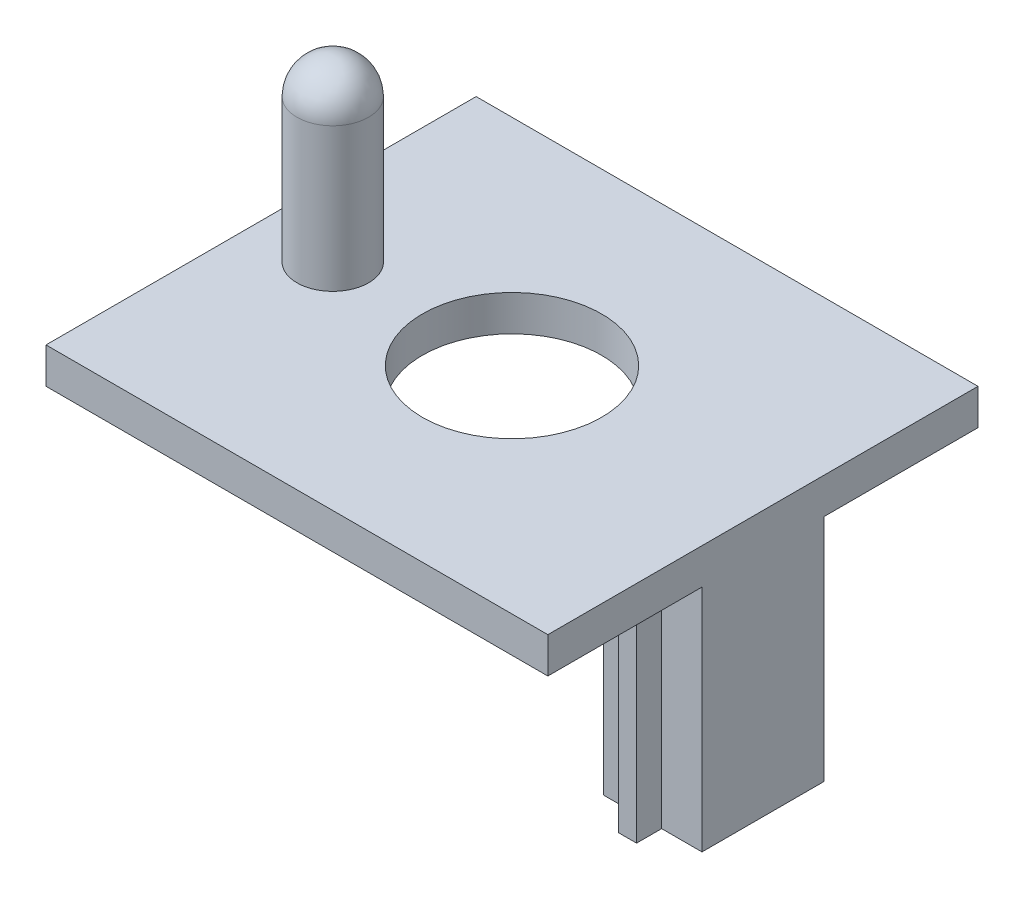
ISO-10303-21;
HEADER;
FILE_DESCRIPTION(('STEP AP214'),'2;1');
FILE_NAME('part.step','',(''),(''),'','','');
FILE_SCHEMA(('AUTOMOTIVE_DESIGN { 1 0 10303 214 1 1 1 1 }'));
ENDSEC;
DATA;
#1=APPLICATION_CONTEXT('core data for automotive mechanical design processes');
#2=APPLICATION_PROTOCOL_DEFINITION('international standard','automotive_design',2000,#1);
#3=PRODUCT_CONTEXT('',#1,'mechanical');
#4=PRODUCT('Part','Part','',(#3));
#5=PRODUCT_RELATED_PRODUCT_CATEGORY('part','',(#4));
#6=PRODUCT_DEFINITION_FORMATION('','',#4);
#7=PRODUCT_DEFINITION_CONTEXT('part definition',#1,'design');
#8=PRODUCT_DEFINITION('design','',#6,#7);
#9=PRODUCT_DEFINITION_SHAPE('','',#8);
#10=(LENGTH_UNIT() NAMED_UNIT(*) SI_UNIT(.MILLI.,.METRE.));
#11=(NAMED_UNIT(*) PLANE_ANGLE_UNIT() SI_UNIT($,.RADIAN.));
#12=(NAMED_UNIT(*) SI_UNIT($,.STERADIAN.) SOLID_ANGLE_UNIT());
#13=UNCERTAINTY_MEASURE_WITH_UNIT(LENGTH_MEASURE(1.E-05),#10,'distance_accuracy_value','');
#14=(GEOMETRIC_REPRESENTATION_CONTEXT(3) GLOBAL_UNCERTAINTY_ASSIGNED_CONTEXT((#13)) GLOBAL_UNIT_ASSIGNED_CONTEXT((#10,
#11,#12)) REPRESENTATION_CONTEXT('',''));
#15=CARTESIAN_POINT('',(0.,0.,0.));
#16=DIRECTION('',(0.,0.,1.));
#17=DIRECTION('',(1.,0.,0.));
#18=AXIS2_PLACEMENT_3D('',#15,#16,#17);
#19=CARTESIAN_POINT('',(0.,5.,0.));
#20=DIRECTION('',(0.,1.,0.));
#21=DIRECTION('',(0.,0.,1.));
#22=AXIS2_PLACEMENT_3D('',#19,#20,#21);
#23=PLANE('',#22);
#24=CARTESIAN_POINT('',(-25.,5.,0.));
#25=DIRECTION('',(0.,1.,0.));
#26=DIRECTION('',(0.,0.,1.));
#27=AXIS2_PLACEMENT_3D('',#24,#25,#26);
#28=CIRCLE('',#27,5.);
#29=CARTESIAN_POINT('',(-25.,5.,5.));
#30=VERTEX_POINT('',#29);
#31=EDGE_CURVE('E233',#30,#30,#28,.T.);
#32=ORIENTED_EDGE('',*,*,#31,.F.);
#33=EDGE_LOOP('',(#32));
#34=FACE_BOUND('',#33,.T.);
#35=DIRECTION('',(0.,0.,-1.));
#36=VECTOR('',#35,1.);
#37=CARTESIAN_POINT('',(35.,5.,-30.));
#38=LINE('',#37,#36);
#39=CARTESIAN_POINT('',(35.,5.,30.));
#40=VERTEX_POINT('',#39);
#41=CARTESIAN_POINT('',(35.,5.,-30.));
#42=VERTEX_POINT('',#41);
#43=EDGE_CURVE('E310',#40,#42,#38,.T.);
#44=ORIENTED_EDGE('',*,*,#43,.T.);
#45=DIRECTION('',(-1.,0.,0.));
#46=VECTOR('',#45,1.);
#47=CARTESIAN_POINT('',(-35.,5.,-30.));
#48=LINE('',#47,#46);
#49=CARTESIAN_POINT('',(-35.,5.,-30.));
#50=VERTEX_POINT('',#49);
#51=EDGE_CURVE('E101',#42,#50,#48,.T.);
#52=ORIENTED_EDGE('',*,*,#51,.T.);
#53=DIRECTION('',(0.,0.,1.));
#54=VECTOR('',#53,1.);
#55=CARTESIAN_POINT('',(-35.,5.,-30.));
#56=LINE('',#55,#54);
#57=CARTESIAN_POINT('',(-35.,5.,30.));
#58=VERTEX_POINT('',#57);
#59=EDGE_CURVE('E315',#50,#58,#56,.T.);
#60=ORIENTED_EDGE('',*,*,#59,.T.);
#61=DIRECTION('',(1.,0.,0.));
#62=VECTOR('',#61,1.);
#63=CARTESIAN_POINT('',(-35.,5.,30.));
#64=LINE('',#63,#62);
#65=EDGE_CURVE('E72',#58,#40,#64,.T.);
#66=ORIENTED_EDGE('',*,*,#65,.T.);
#67=EDGE_LOOP('',(#44,#52,#60,#66));
#68=FACE_BOUND('',#67,.T.);
#69=CARTESIAN_POINT('',(0.,5.,0.));
#70=DIRECTION('',(0.,1.,0.));
#71=DIRECTION('',(0.,0.,1.));
#72=AXIS2_PLACEMENT_3D('',#69,#70,#71);
#73=CIRCLE('',#72,12.5);
#74=CARTESIAN_POINT('',(0.,5.,12.5));
#75=VERTEX_POINT('',#74);
#76=EDGE_CURVE('E302',#75,#75,#73,.T.);
#77=ORIENTED_EDGE('',*,*,#76,.F.);
#78=EDGE_LOOP('',(#77));
#79=FACE_BOUND('',#78,.T.);
#80=ADVANCED_FACE('F47',(#34,#68,#79),#23,.T.);
#81=CARTESIAN_POINT('',(0.,0.,0.));
#82=DIRECTION('',(0.,1.,0.));
#83=DIRECTION('',(0.,0.,1.));
#84=AXIS2_PLACEMENT_3D('',#81,#82,#83);
#85=PLANE('',#84);
#86=DIRECTION('',(0.,0.,-1.));
#87=VECTOR('',#86,1.);
#88=CARTESIAN_POINT('',(29.375,0.,0.));
#89=LINE('',#88,#87);
#90=CARTESIAN_POINT('',(29.375,0.,12.));
#91=VERTEX_POINT('',#90);
#92=CARTESIAN_POINT('',(29.375,0.,8.5));
#93=VERTEX_POINT('',#92);
#94=EDGE_CURVE('E232',#91,#93,#89,.T.);
#95=ORIENTED_EDGE('',*,*,#94,.T.);
#96=DIRECTION('',(1.,0.,0.));
#97=VECTOR('',#96,1.);
#98=CARTESIAN_POINT('',(0.,0.,8.5));
#99=LINE('',#98,#97);
#100=CARTESIAN_POINT('',(35.,0.,8.5));
#101=VERTEX_POINT('',#100);
#102=EDGE_CURVE('E63',#93,#101,#99,.T.);
#103=ORIENTED_EDGE('',*,*,#102,.T.);
#104=DIRECTION('',(0.,0.,-1.));
#105=VECTOR('',#104,1.);
#106=CARTESIAN_POINT('',(35.,0.,-30.));
#107=LINE('',#106,#105);
#108=CARTESIAN_POINT('',(35.,0.,30.));
#109=VERTEX_POINT('',#108);
#110=EDGE_CURVE('E321',#109,#101,#107,.T.);
#111=ORIENTED_EDGE('',*,*,#110,.F.);
#112=DIRECTION('',(1.,0.,0.));
#113=VECTOR('',#112,1.);
#114=CARTESIAN_POINT('',(-35.,0.,30.));
#115=LINE('',#114,#113);
#116=CARTESIAN_POINT('',(-35.,0.,30.));
#117=VERTEX_POINT('',#116);
#118=EDGE_CURVE('E93',#117,#109,#115,.T.);
#119=ORIENTED_EDGE('',*,*,#118,.F.);
#120=DIRECTION('',(0.,0.,1.));
#121=VECTOR('',#120,1.);
#122=CARTESIAN_POINT('',(-35.,0.,-30.));
#123=LINE('',#122,#121);
#124=CARTESIAN_POINT('',(-35.,0.,-30.));
#125=VERTEX_POINT('',#124);
#126=EDGE_CURVE('E328',#125,#117,#123,.T.);
#127=ORIENTED_EDGE('',*,*,#126,.F.);
#128=DIRECTION('',(-1.,0.,0.));
#129=VECTOR('',#128,1.);
#130=CARTESIAN_POINT('',(-35.,0.,-30.));
#131=LINE('',#130,#129);
#132=CARTESIAN_POINT('',(35.,0.,-30.));
#133=VERTEX_POINT('',#132);
#134=EDGE_CURVE('E325',#133,#125,#131,.T.);
#135=ORIENTED_EDGE('',*,*,#134,.F.);
#136=CARTESIAN_POINT('',(35.,0.,-8.5));
#137=VERTEX_POINT('',#136);
#138=EDGE_CURVE('E306',#137,#133,#107,.T.);
#139=ORIENTED_EDGE('',*,*,#138,.F.);
#140=DIRECTION('',(1.,0.,0.));
#141=VECTOR('',#140,1.);
#142=CARTESIAN_POINT('',(0.,0.,-8.5));
#143=LINE('',#142,#141);
#144=CARTESIAN_POINT('',(29.375,0.,-8.5));
#145=VERTEX_POINT('',#144);
#146=EDGE_CURVE('E191',#145,#137,#143,.T.);
#147=ORIENTED_EDGE('',*,*,#146,.F.);
#148=DIRECTION('',(0.,0.,-1.));
#149=VECTOR('',#148,1.);
#150=CARTESIAN_POINT('',(29.375,0.,0.));
#151=LINE('',#150,#149);
#152=CARTESIAN_POINT('',(29.375,0.,-12.));
#153=VERTEX_POINT('',#152);
#154=EDGE_CURVE('E261',#145,#153,#151,.T.);
#155=ORIENTED_EDGE('',*,*,#154,.T.);
#156=DIRECTION('',(1.,0.,0.));
#157=VECTOR('',#156,1.);
#158=CARTESIAN_POINT('',(0.,0.,-12.));
#159=LINE('',#158,#157);
#160=CARTESIAN_POINT('',(26.875,0.,-12.));
#161=VERTEX_POINT('',#160);
#162=EDGE_CURVE('E257',#161,#153,#159,.T.);
#163=ORIENTED_EDGE('',*,*,#162,.F.);
#164=DIRECTION('',(0.,0.,-1.));
#165=VECTOR('',#164,1.);
#166=CARTESIAN_POINT('',(26.875,0.,0.));
#167=LINE('',#166,#165);
#168=CARTESIAN_POINT('',(26.875,0.,-8.5));
#169=VERTEX_POINT('',#168);
#170=EDGE_CURVE('E254',#169,#161,#167,.T.);
#171=ORIENTED_EDGE('',*,*,#170,.F.);
#172=DIRECTION('',(1.,0.,0.));
#173=VECTOR('',#172,1.);
#174=CARTESIAN_POINT('',(0.,0.,-8.5));
#175=LINE('',#174,#173);
#176=CARTESIAN_POINT('',(21.25,0.,-8.5));
#177=VERTEX_POINT('',#176);
#178=EDGE_CURVE('E251',#177,#169,#175,.T.);
#179=ORIENTED_EDGE('',*,*,#178,.F.);
#180=DIRECTION('',(0.,0.,-1.));
#181=VECTOR('',#180,1.);
#182=CARTESIAN_POINT('',(21.25,0.,0.));
#183=LINE('',#182,#181);
#184=CARTESIAN_POINT('',(21.25,0.,8.5));
#185=VERTEX_POINT('',#184);
#186=EDGE_CURVE('E248',#185,#177,#183,.T.);
#187=ORIENTED_EDGE('',*,*,#186,.F.);
#188=DIRECTION('',(1.,0.,0.));
#189=VECTOR('',#188,1.);
#190=CARTESIAN_POINT('',(0.,0.,8.5));
#191=LINE('',#190,#189);
#192=CARTESIAN_POINT('',(26.875,0.,8.5));
#193=VERTEX_POINT('',#192);
#194=EDGE_CURVE('E244',#185,#193,#191,.T.);
#195=ORIENTED_EDGE('',*,*,#194,.T.);
#196=DIRECTION('',(0.,0.,-1.));
#197=VECTOR('',#196,1.);
#198=CARTESIAN_POINT('',(26.875,0.,0.));
#199=LINE('',#198,#197);
#200=CARTESIAN_POINT('',(26.875,0.,12.));
#201=VERTEX_POINT('',#200);
#202=EDGE_CURVE('E240',#201,#193,#199,.T.);
#203=ORIENTED_EDGE('',*,*,#202,.F.);
#204=DIRECTION('',(1.,0.,0.));
#205=VECTOR('',#204,1.);
#206=CARTESIAN_POINT('',(0.,0.,12.));
#207=LINE('',#206,#205);
#208=EDGE_CURVE('E236',#201,#91,#207,.T.);
#209=ORIENTED_EDGE('',*,*,#208,.T.);
#210=EDGE_LOOP('',(#95,#103,#111,#119,#127,#135,#139,#147,#155,#163,#171,#179,#187,#195,#203,#209));
#211=FACE_BOUND('',#210,.T.);
#212=CARTESIAN_POINT('',(0.,0.,0.));
#213=DIRECTION('',(0.,1.,0.));
#214=DIRECTION('',(0.,0.,1.));
#215=AXIS2_PLACEMENT_3D('',#212,#213,#214);
#216=CIRCLE('',#215,12.5);
#217=CARTESIAN_POINT('',(0.,0.,12.5));
#218=VERTEX_POINT('',#217);
#219=EDGE_CURVE('E178',#218,#218,#216,.T.);
#220=ORIENTED_EDGE('',*,*,#219,.T.);
#221=EDGE_LOOP('',(#220));
#222=FACE_BOUND('',#221,.T.);
#223=ADVANCED_FACE('F354',(#211,#222),#85,.F.);
#224=CARTESIAN_POINT('',(35.,5.,-30.));
#225=DIRECTION('',(-1.,0.,0.));
#226=DIRECTION('',(0.,0.,1.));
#227=AXIS2_PLACEMENT_3D('',#224,#225,#226);
#228=PLANE('',#227);
#229=ORIENTED_EDGE('',*,*,#110,.T.);
#230=DIRECTION('',(0.,1.,0.));
#231=VECTOR('',#230,1.);
#232=CARTESIAN_POINT('',(35.,-32.,8.5));
#233=LINE('',#232,#231);
#234=CARTESIAN_POINT('',(35.,-32.,8.5));
#235=VERTEX_POINT('',#234);
#236=EDGE_CURVE('E229',#235,#101,#233,.T.);
#237=ORIENTED_EDGE('',*,*,#236,.F.);
#238=DIRECTION('',(0.,0.,1.));
#239=VECTOR('',#238,1.);
#240=CARTESIAN_POINT('',(35.,-32.,0.));
#241=LINE('',#240,#239);
#242=CARTESIAN_POINT('',(35.,-32.,-8.5));
#243=VERTEX_POINT('',#242);
#244=EDGE_CURVE('E188',#243,#235,#241,.T.);
#245=ORIENTED_EDGE('',*,*,#244,.F.);
#246=DIRECTION('',(0.,1.,0.));
#247=VECTOR('',#246,1.);
#248=CARTESIAN_POINT('',(35.,-32.,-8.5));
#249=LINE('',#248,#247);
#250=EDGE_CURVE('E269',#243,#137,#249,.T.);
#251=ORIENTED_EDGE('',*,*,#250,.T.);
#252=ORIENTED_EDGE('',*,*,#138,.T.);
#253=DIRECTION('',(0.,-1.,0.));
#254=VECTOR('',#253,1.);
#255=CARTESIAN_POINT('',(35.,5.,-30.));
#256=LINE('',#255,#254);
#257=EDGE_CURVE('E56',#42,#133,#256,.T.);
#258=ORIENTED_EDGE('',*,*,#257,.F.);
#259=ORIENTED_EDGE('',*,*,#43,.F.);
#260=DIRECTION('',(0.,-1.,0.));
#261=VECTOR('',#260,1.);
#262=CARTESIAN_POINT('',(35.,5.,30.));
#263=LINE('',#262,#261);
#264=EDGE_CURVE('E320',#40,#109,#263,.T.);
#265=ORIENTED_EDGE('',*,*,#264,.T.);
#266=EDGE_LOOP('',(#229,#237,#245,#251,#252,#258,#259,#265));
#267=FACE_BOUND('',#266,.T.);
#268=ADVANCED_FACE('F347',(#267),#228,.F.);
#269=CARTESIAN_POINT('',(-35.,5.,-30.));
#270=DIRECTION('',(0.,0.,1.));
#271=DIRECTION('',(1.,0.,0.));
#272=AXIS2_PLACEMENT_3D('',#269,#270,#271);
#273=PLANE('',#272);
#274=ORIENTED_EDGE('',*,*,#134,.T.);
#275=DIRECTION('',(0.,-1.,0.));
#276=VECTOR('',#275,1.);
#277=CARTESIAN_POINT('',(-35.,5.,-30.));
#278=LINE('',#277,#276);
#279=EDGE_CURVE('E338',#50,#125,#278,.T.);
#280=ORIENTED_EDGE('',*,*,#279,.F.);
#281=ORIENTED_EDGE('',*,*,#51,.F.);
#282=ORIENTED_EDGE('',*,*,#257,.T.);
#283=EDGE_LOOP('',(#274,#280,#281,#282));
#284=FACE_BOUND('',#283,.T.);
#285=ADVANCED_FACE('F343',(#284),#273,.F.);
#286=CARTESIAN_POINT('',(-35.,5.,-30.));
#287=DIRECTION('',(1.,0.,0.));
#288=DIRECTION('',(0.,0.,-1.));
#289=AXIS2_PLACEMENT_3D('',#286,#287,#288);
#290=PLANE('',#289);
#291=ORIENTED_EDGE('',*,*,#126,.T.);
#292=DIRECTION('',(0.,-1.,0.));
#293=VECTOR('',#292,1.);
#294=CARTESIAN_POINT('',(-35.,5.,30.));
#295=LINE('',#294,#293);
#296=EDGE_CURVE('E335',#58,#117,#295,.T.);
#297=ORIENTED_EDGE('',*,*,#296,.F.);
#298=ORIENTED_EDGE('',*,*,#59,.F.);
#299=ORIENTED_EDGE('',*,*,#279,.T.);
#300=EDGE_LOOP('',(#291,#297,#298,#299));
#301=FACE_BOUND('',#300,.T.);
#302=ADVANCED_FACE('F359',(#301),#290,.F.);
#303=CARTESIAN_POINT('',(-35.,5.,30.));
#304=DIRECTION('',(0.,0.,-1.));
#305=DIRECTION('',(-1.,0.,0.));
#306=AXIS2_PLACEMENT_3D('',#303,#304,#305);
#307=PLANE('',#306);
#308=ORIENTED_EDGE('',*,*,#118,.T.);
#309=ORIENTED_EDGE('',*,*,#264,.F.);
#310=ORIENTED_EDGE('',*,*,#65,.F.);
#311=ORIENTED_EDGE('',*,*,#296,.T.);
#312=EDGE_LOOP('',(#308,#309,#310,#311));
#313=FACE_BOUND('',#312,.T.);
#314=ADVANCED_FACE('F361',(#313),#307,.F.);
#315=CARTESIAN_POINT('',(0.,5.,0.));
#316=DIRECTION('',(0.,-1.,0.));
#317=DIRECTION('',(0.,0.,-1.));
#318=AXIS2_PLACEMENT_3D('',#315,#316,#317);
#319=CYLINDRICAL_SURFACE('',#318,12.5);
#320=ORIENTED_EDGE('',*,*,#76,.T.);
#321=EDGE_LOOP('',(#320));
#322=FACE_BOUND('',#321,.T.);
#323=ORIENTED_EDGE('',*,*,#219,.F.);
#324=EDGE_LOOP('',(#323));
#325=FACE_BOUND('',#324,.T.);
#326=ADVANCED_FACE('F420',(#322,#325),#319,.F.);
#327=CARTESIAN_POINT('',(0.,-32.,8.5));
#328=DIRECTION('',(0.,0.,1.));
#329=DIRECTION('',(1.,0.,0.));
#330=AXIS2_PLACEMENT_3D('',#327,#328,#329);
#331=PLANE('',#330);
#332=ORIENTED_EDGE('',*,*,#102,.F.);
#333=DIRECTION('',(0.,1.,0.));
#334=VECTOR('',#333,1.);
#335=CARTESIAN_POINT('',(29.375,-32.,8.5));
#336=LINE('',#335,#334);
#337=CARTESIAN_POINT('',(29.375,-32.,8.5));
#338=VERTEX_POINT('',#337);
#339=EDGE_CURVE('E169',#338,#93,#336,.T.);
#340=ORIENTED_EDGE('',*,*,#339,.F.);
#341=DIRECTION('',(1.,0.,0.));
#342=VECTOR('',#341,1.);
#343=CARTESIAN_POINT('',(0.,-32.,8.5));
#344=LINE('',#343,#342);
#345=EDGE_CURVE('E172',#338,#235,#344,.T.);
#346=ORIENTED_EDGE('',*,*,#345,.T.);
#347=ORIENTED_EDGE('',*,*,#236,.T.);
#348=EDGE_LOOP('',(#332,#340,#346,#347));
#349=FACE_BOUND('',#348,.T.);
#350=ADVANCED_FACE('F171',(#349),#331,.T.);
#351=CARTESIAN_POINT('',(29.375,-32.,0.));
#352=DIRECTION('',(1.,0.,0.));
#353=DIRECTION('',(0.,0.,-1.));
#354=AXIS2_PLACEMENT_3D('',#351,#352,#353);
#355=PLANE('',#354);
#356=ORIENTED_EDGE('',*,*,#94,.F.);
#357=DIRECTION('',(0.,1.,0.));
#358=VECTOR('',#357,1.);
#359=CARTESIAN_POINT('',(29.375,-32.,12.));
#360=LINE('',#359,#358);
#361=CARTESIAN_POINT('',(29.375,-32.,12.));
#362=VERTEX_POINT('',#361);
#363=EDGE_CURVE('E179',#362,#91,#360,.T.);
#364=ORIENTED_EDGE('',*,*,#363,.F.);
#365=DIRECTION('',(0.,0.,-1.));
#366=VECTOR('',#365,1.);
#367=CARTESIAN_POINT('',(29.375,-32.,0.));
#368=LINE('',#367,#366);
#369=EDGE_CURVE('E185',#362,#338,#368,.T.);
#370=ORIENTED_EDGE('',*,*,#369,.T.);
#371=ORIENTED_EDGE('',*,*,#339,.T.);
#372=EDGE_LOOP('',(#356,#364,#370,#371));
#373=FACE_BOUND('',#372,.T.);
#374=ADVANCED_FACE('F193',(#373),#355,.T.);
#375=CARTESIAN_POINT('',(0.,-32.,12.));
#376=DIRECTION('',(0.,0.,1.));
#377=DIRECTION('',(1.,0.,0.));
#378=AXIS2_PLACEMENT_3D('',#375,#376,#377);
#379=PLANE('',#378);
#380=ORIENTED_EDGE('',*,*,#208,.F.);
#381=DIRECTION('',(0.,1.,0.));
#382=VECTOR('',#381,1.);
#383=CARTESIAN_POINT('',(26.875,-32.,12.));
#384=LINE('',#383,#382);
#385=CARTESIAN_POINT('',(26.875,-32.,12.));
#386=VERTEX_POINT('',#385);
#387=EDGE_CURVE('E297',#386,#201,#384,.T.);
#388=ORIENTED_EDGE('',*,*,#387,.F.);
#389=DIRECTION('',(1.,0.,0.));
#390=VECTOR('',#389,1.);
#391=CARTESIAN_POINT('',(0.,-32.,12.));
#392=LINE('',#391,#390);
#393=EDGE_CURVE('E195',#386,#362,#392,.T.);
#394=ORIENTED_EDGE('',*,*,#393,.T.);
#395=ORIENTED_EDGE('',*,*,#363,.T.);
#396=EDGE_LOOP('',(#380,#388,#394,#395));
#397=FACE_BOUND('',#396,.T.);
#398=ADVANCED_FACE('F365',(#397),#379,.T.);
#399=CARTESIAN_POINT('',(26.875,-32.,0.));
#400=DIRECTION('',(1.,0.,0.));
#401=DIRECTION('',(0.,0.,-1.));
#402=AXIS2_PLACEMENT_3D('',#399,#400,#401);
#403=PLANE('',#402);
#404=ORIENTED_EDGE('',*,*,#202,.T.);
#405=DIRECTION('',(0.,1.,0.));
#406=VECTOR('',#405,1.);
#407=CARTESIAN_POINT('',(26.875,-32.,8.5));
#408=LINE('',#407,#406);
#409=CARTESIAN_POINT('',(26.875,-32.,8.5));
#410=VERTEX_POINT('',#409);
#411=EDGE_CURVE('E294',#410,#193,#408,.T.);
#412=ORIENTED_EDGE('',*,*,#411,.F.);
#413=DIRECTION('',(0.,0.,-1.));
#414=VECTOR('',#413,1.);
#415=CARTESIAN_POINT('',(26.875,-32.,0.));
#416=LINE('',#415,#414);
#417=EDGE_CURVE('E198',#386,#410,#416,.T.);
#418=ORIENTED_EDGE('',*,*,#417,.F.);
#419=ORIENTED_EDGE('',*,*,#387,.T.);
#420=EDGE_LOOP('',(#404,#412,#418,#419));
#421=FACE_BOUND('',#420,.T.);
#422=ADVANCED_FACE('F370',(#421),#403,.F.);
#423=CARTESIAN_POINT('',(0.,-32.,8.5));
#424=DIRECTION('',(0.,0.,1.));
#425=DIRECTION('',(1.,0.,0.));
#426=AXIS2_PLACEMENT_3D('',#423,#424,#425);
#427=PLANE('',#426);
#428=ORIENTED_EDGE('',*,*,#194,.F.);
#429=DIRECTION('',(0.,1.,0.));
#430=VECTOR('',#429,1.);
#431=CARTESIAN_POINT('',(21.25,-32.,8.5));
#432=LINE('',#431,#430);
#433=CARTESIAN_POINT('',(21.25,-32.,8.5));
#434=VERTEX_POINT('',#433);
#435=EDGE_CURVE('E291',#434,#185,#432,.T.);
#436=ORIENTED_EDGE('',*,*,#435,.F.);
#437=DIRECTION('',(1.,0.,0.));
#438=VECTOR('',#437,1.);
#439=CARTESIAN_POINT('',(0.,-32.,8.5));
#440=LINE('',#439,#438);
#441=EDGE_CURVE('E204',#434,#410,#440,.T.);
#442=ORIENTED_EDGE('',*,*,#441,.T.);
#443=ORIENTED_EDGE('',*,*,#411,.T.);
#444=EDGE_LOOP('',(#428,#436,#442,#443));
#445=FACE_BOUND('',#444,.T.);
#446=ADVANCED_FACE('F373',(#445),#427,.T.);
#447=CARTESIAN_POINT('',(21.25,-32.,0.));
#448=DIRECTION('',(1.,0.,0.));
#449=DIRECTION('',(0.,0.,-1.));
#450=AXIS2_PLACEMENT_3D('',#447,#448,#449);
#451=PLANE('',#450);
#452=ORIENTED_EDGE('',*,*,#186,.T.);
#453=DIRECTION('',(0.,1.,0.));
#454=VECTOR('',#453,1.);
#455=CARTESIAN_POINT('',(21.25,-32.,-8.5));
#456=LINE('',#455,#454);
#457=CARTESIAN_POINT('',(21.25,-32.,-8.5));
#458=VERTEX_POINT('',#457);
#459=EDGE_CURVE('E287',#458,#177,#456,.T.);
#460=ORIENTED_EDGE('',*,*,#459,.F.);
#461=DIRECTION('',(0.,0.,-1.));
#462=VECTOR('',#461,1.);
#463=CARTESIAN_POINT('',(21.25,-32.,0.));
#464=LINE('',#463,#462);
#465=EDGE_CURVE('E208',#434,#458,#464,.T.);
#466=ORIENTED_EDGE('',*,*,#465,.F.);
#467=ORIENTED_EDGE('',*,*,#435,.T.);
#468=EDGE_LOOP('',(#452,#460,#466,#467));
#469=FACE_BOUND('',#468,.T.);
#470=ADVANCED_FACE('F378',(#469),#451,.F.);
#471=CARTESIAN_POINT('',(0.,-32.,-8.5));
#472=DIRECTION('',(0.,0.,1.));
#473=DIRECTION('',(1.,0.,0.));
#474=AXIS2_PLACEMENT_3D('',#471,#472,#473);
#475=PLANE('',#474);
#476=ORIENTED_EDGE('',*,*,#178,.T.);
#477=DIRECTION('',(0.,1.,0.));
#478=VECTOR('',#477,1.);
#479=CARTESIAN_POINT('',(26.875,-32.,-8.5));
#480=LINE('',#479,#478);
#481=CARTESIAN_POINT('',(26.875,-32.,-8.5));
#482=VERTEX_POINT('',#481);
#483=EDGE_CURVE('E283',#482,#169,#480,.T.);
#484=ORIENTED_EDGE('',*,*,#483,.F.);
#485=DIRECTION('',(1.,0.,0.));
#486=VECTOR('',#485,1.);
#487=CARTESIAN_POINT('',(0.,-32.,-8.5));
#488=LINE('',#487,#486);
#489=EDGE_CURVE('E211',#458,#482,#488,.T.);
#490=ORIENTED_EDGE('',*,*,#489,.F.);
#491=ORIENTED_EDGE('',*,*,#459,.T.);
#492=EDGE_LOOP('',(#476,#484,#490,#491));
#493=FACE_BOUND('',#492,.T.);
#494=ADVANCED_FACE('F384',(#493),#475,.F.);
#495=CARTESIAN_POINT('',(26.875,-32.,0.));
#496=DIRECTION('',(1.,0.,0.));
#497=DIRECTION('',(0.,0.,-1.));
#498=AXIS2_PLACEMENT_3D('',#495,#496,#497);
#499=PLANE('',#498);
#500=ORIENTED_EDGE('',*,*,#170,.T.);
#501=DIRECTION('',(0.,1.,0.));
#502=VECTOR('',#501,1.);
#503=CARTESIAN_POINT('',(26.875,-32.,-12.));
#504=LINE('',#503,#502);
#505=CARTESIAN_POINT('',(26.875,-32.,-12.));
#506=VERTEX_POINT('',#505);
#507=EDGE_CURVE('E279',#506,#161,#504,.T.);
#508=ORIENTED_EDGE('',*,*,#507,.F.);
#509=DIRECTION('',(0.,0.,-1.));
#510=VECTOR('',#509,1.);
#511=CARTESIAN_POINT('',(26.875,-32.,0.));
#512=LINE('',#511,#510);
#513=EDGE_CURVE('E214',#482,#506,#512,.T.);
#514=ORIENTED_EDGE('',*,*,#513,.F.);
#515=ORIENTED_EDGE('',*,*,#483,.T.);
#516=EDGE_LOOP('',(#500,#508,#514,#515));
#517=FACE_BOUND('',#516,.T.);
#518=ADVANCED_FACE('F388',(#517),#499,.F.);
#519=CARTESIAN_POINT('',(0.,-32.,-12.));
#520=DIRECTION('',(0.,0.,1.));
#521=DIRECTION('',(1.,0.,0.));
#522=AXIS2_PLACEMENT_3D('',#519,#520,#521);
#523=PLANE('',#522);
#524=ORIENTED_EDGE('',*,*,#162,.T.);
#525=DIRECTION('',(0.,1.,0.));
#526=VECTOR('',#525,1.);
#527=CARTESIAN_POINT('',(29.375,-32.,-12.));
#528=LINE('',#527,#526);
#529=CARTESIAN_POINT('',(29.375,-32.,-12.));
#530=VERTEX_POINT('',#529);
#531=EDGE_CURVE('E276',#530,#153,#528,.T.);
#532=ORIENTED_EDGE('',*,*,#531,.F.);
#533=DIRECTION('',(1.,0.,0.));
#534=VECTOR('',#533,1.);
#535=CARTESIAN_POINT('',(0.,-32.,-12.));
#536=LINE('',#535,#534);
#537=EDGE_CURVE('E217',#506,#530,#536,.T.);
#538=ORIENTED_EDGE('',*,*,#537,.F.);
#539=ORIENTED_EDGE('',*,*,#507,.T.);
#540=EDGE_LOOP('',(#524,#532,#538,#539));
#541=FACE_BOUND('',#540,.T.);
#542=ADVANCED_FACE('F393',(#541),#523,.F.);
#543=CARTESIAN_POINT('',(29.375,-32.,0.));
#544=DIRECTION('',(1.,0.,0.));
#545=DIRECTION('',(0.,0.,-1.));
#546=AXIS2_PLACEMENT_3D('',#543,#544,#545);
#547=PLANE('',#546);
#548=ORIENTED_EDGE('',*,*,#154,.F.);
#549=DIRECTION('',(0.,1.,0.));
#550=VECTOR('',#549,1.);
#551=CARTESIAN_POINT('',(29.375,-32.,-8.5));
#552=LINE('',#551,#550);
#553=CARTESIAN_POINT('',(29.375,-32.,-8.5));
#554=VERTEX_POINT('',#553);
#555=EDGE_CURVE('E273',#554,#145,#552,.T.);
#556=ORIENTED_EDGE('',*,*,#555,.F.);
#557=DIRECTION('',(0.,0.,-1.));
#558=VECTOR('',#557,1.);
#559=CARTESIAN_POINT('',(29.375,-32.,0.));
#560=LINE('',#559,#558);
#561=EDGE_CURVE('E220',#554,#530,#560,.T.);
#562=ORIENTED_EDGE('',*,*,#561,.T.);
#563=ORIENTED_EDGE('',*,*,#531,.T.);
#564=EDGE_LOOP('',(#548,#556,#562,#563));
#565=FACE_BOUND('',#564,.T.);
#566=ADVANCED_FACE('F398',(#565),#547,.T.);
#567=CARTESIAN_POINT('',(0.,-32.,-8.5));
#568=DIRECTION('',(0.,0.,1.));
#569=DIRECTION('',(1.,0.,0.));
#570=AXIS2_PLACEMENT_3D('',#567,#568,#569);
#571=PLANE('',#570);
#572=ORIENTED_EDGE('',*,*,#146,.T.);
#573=ORIENTED_EDGE('',*,*,#250,.F.);
#574=DIRECTION('',(1.,0.,0.));
#575=VECTOR('',#574,1.);
#576=CARTESIAN_POINT('',(0.,-32.,-8.5));
#577=LINE('',#576,#575);
#578=EDGE_CURVE('E224',#554,#243,#577,.T.);
#579=ORIENTED_EDGE('',*,*,#578,.F.);
#580=ORIENTED_EDGE('',*,*,#555,.T.);
#581=EDGE_LOOP('',(#572,#573,#579,#580));
#582=FACE_BOUND('',#581,.T.);
#583=ADVANCED_FACE('F400',(#582),#571,.F.);
#584=CARTESIAN_POINT('',(0.,-32.,0.));
#585=DIRECTION('',(0.,-1.,0.));
#586=DIRECTION('',(0.,0.,-1.));
#587=AXIS2_PLACEMENT_3D('',#584,#585,#586);
#588=PLANE('',#587);
#589=ORIENTED_EDGE('',*,*,#345,.F.);
#590=ORIENTED_EDGE('',*,*,#369,.F.);
#591=ORIENTED_EDGE('',*,*,#393,.F.);
#592=ORIENTED_EDGE('',*,*,#417,.T.);
#593=ORIENTED_EDGE('',*,*,#441,.F.);
#594=ORIENTED_EDGE('',*,*,#465,.T.);
#595=ORIENTED_EDGE('',*,*,#489,.T.);
#596=ORIENTED_EDGE('',*,*,#513,.T.);
#597=ORIENTED_EDGE('',*,*,#537,.T.);
#598=ORIENTED_EDGE('',*,*,#561,.F.);
#599=ORIENTED_EDGE('',*,*,#578,.T.);
#600=ORIENTED_EDGE('',*,*,#244,.T.);
#601=EDGE_LOOP('',(#589,#590,#591,#592,#593,#594,#595,#596,#597,#598,#599,#600));
#602=FACE_BOUND('',#601,.T.);
#603=ADVANCED_FACE('F183',(#602),#588,.T.);
#604=CARTESIAN_POINT('',(-25.,30.,0.));
#605=DIRECTION('',(0.,-1.,0.));
#606=DIRECTION('',(0.,0.,-1.));
#607=AXIS2_PLACEMENT_3D('',#604,#605,#606);
#608=CYLINDRICAL_SURFACE('',#607,5.);
#609=CARTESIAN_POINT('',(-25.,25.,0.));
#610=DIRECTION('',(0.,-1.,0.));
#611=DIRECTION('',(0.,0.,-1.));
#612=AXIS2_PLACEMENT_3D('',#609,#610,#611);
#613=CIRCLE('',#612,5.);
#614=CARTESIAN_POINT('',(-25.,25.,-5.));
#615=VERTEX_POINT('',#614);
#616=EDGE_CURVE('E11',#615,#615,#613,.T.);
#617=ORIENTED_EDGE('',*,*,#616,.T.);
#618=EDGE_LOOP('',(#617));
#619=FACE_BOUND('',#618,.T.);
#620=ORIENTED_EDGE('',*,*,#31,.T.);
#621=EDGE_LOOP('',(#620));
#622=FACE_BOUND('',#621,.T.);
#623=ADVANCED_FACE('F407',(#619,#622),#608,.T.);
#624=CARTESIAN_POINT('',(-25.,25.,0.));
#625=DIRECTION('',(0.,1.,0.));
#626=DIRECTION('',(0.,0.,1.));
#627=AXIS2_PLACEMENT_3D('',#624,#625,#626);
#628=SPHERICAL_SURFACE('',#627,5.);
#629=ORIENTED_EDGE('',*,*,#616,.F.);
#630=EDGE_LOOP('',(#629));
#631=FACE_BOUND('',#630,.T.);
#632=ADVANCED_FACE('F49',(#631),#628,.T.);
#633=CLOSED_SHELL('',(#80,#223,#268,#285,#302,#314,#326,#350,#374,#398,#422,#446,#470,#494,#518,
#542,#566,#583,#603,#623,#632));
#634=MANIFOLD_SOLID_BREP('B2',#633);
#635=ADVANCED_BREP_SHAPE_REPRESENTATION('',(#18,#634),#14);
#636=SHAPE_DEFINITION_REPRESENTATION(#9,#635);
ENDSEC;
END-ISO-10303-21;
